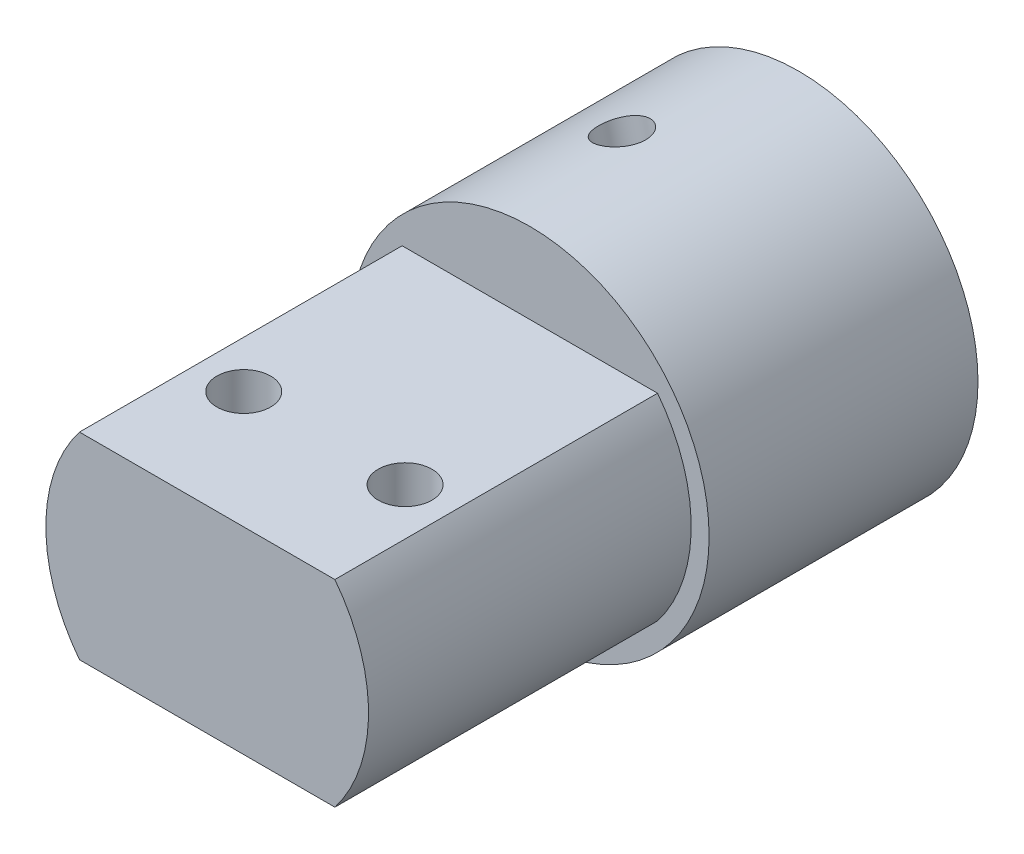
ISO-10303-21;
HEADER;
FILE_DESCRIPTION(('STEP AP214'),'2;1');
FILE_NAME('part.step','',(''),(''),'','','');
FILE_SCHEMA(('AUTOMOTIVE_DESIGN { 1 0 10303 214 1 1 1 1 }'));
ENDSEC;
DATA;
#1=APPLICATION_CONTEXT('core data for automotive mechanical design processes');
#2=APPLICATION_PROTOCOL_DEFINITION('international standard','automotive_design',2000,#1);
#3=PRODUCT_CONTEXT('',#1,'mechanical');
#4=PRODUCT('Part','Part','',(#3));
#5=PRODUCT_RELATED_PRODUCT_CATEGORY('part','',(#4));
#6=PRODUCT_DEFINITION_FORMATION('','',#4);
#7=PRODUCT_DEFINITION_CONTEXT('part definition',#1,'design');
#8=PRODUCT_DEFINITION('design','',#6,#7);
#9=PRODUCT_DEFINITION_SHAPE('','',#8);
#10=(LENGTH_UNIT() NAMED_UNIT(*) SI_UNIT(.MILLI.,.METRE.));
#11=(NAMED_UNIT(*) PLANE_ANGLE_UNIT() SI_UNIT($,.RADIAN.));
#12=(NAMED_UNIT(*) SI_UNIT($,.STERADIAN.) SOLID_ANGLE_UNIT());
#13=UNCERTAINTY_MEASURE_WITH_UNIT(LENGTH_MEASURE(1.E-05),#10,'distance_accuracy_value','');
#14=(GEOMETRIC_REPRESENTATION_CONTEXT(3) GLOBAL_UNCERTAINTY_ASSIGNED_CONTEXT((#13)) GLOBAL_UNIT_ASSIGNED_CONTEXT((#10,
#11,#12)) REPRESENTATION_CONTEXT('',''));
#15=CARTESIAN_POINT('',(0.,0.,0.));
#16=DIRECTION('',(0.,0.,1.));
#17=DIRECTION('',(1.,0.,0.));
#18=AXIS2_PLACEMENT_3D('',#15,#16,#17);
#19=CARTESIAN_POINT('',(0.,0.,15.));
#20=DIRECTION('',(0.,0.,1.));
#21=DIRECTION('',(1.,0.,0.));
#22=AXIS2_PLACEMENT_3D('',#19,#20,#21);
#23=PLANE('',#22);
#24=CARTESIAN_POINT('',(0.,0.,15.));
#25=DIRECTION('',(0.,0.,1.));
#26=DIRECTION('',(1.,0.,0.));
#27=AXIS2_PLACEMENT_3D('',#24,#25,#26);
#28=CIRCLE('',#27,9.);
#29=CARTESIAN_POINT('',(-7.1239034243875,5.5,15.));
#30=VERTEX_POINT('',#29);
#31=CARTESIAN_POINT('',(-7.1239034243875,-5.5,15.));
#32=VERTEX_POINT('',#31);
#33=EDGE_CURVE('E11',#30,#32,#28,.T.);
#34=ORIENTED_EDGE('',*,*,#33,.F.);
#35=DIRECTION('',(-1.,0.,0.));
#36=VECTOR('',#35,1.);
#37=CARTESIAN_POINT('',(-7.1239034243875,5.5,15.));
#38=LINE('',#37,#36);
#39=CARTESIAN_POINT('',(7.1239034243875,5.5,15.0000000000001));
#40=VERTEX_POINT('',#39);
#41=EDGE_CURVE('E133',#40,#30,#38,.T.);
#42=ORIENTED_EDGE('',*,*,#41,.F.);
#43=CARTESIAN_POINT('',(0.,0.,15.));
#44=DIRECTION('',(0.,0.,1.));
#45=DIRECTION('',(1.,0.,0.));
#46=AXIS2_PLACEMENT_3D('',#43,#44,#45);
#47=CIRCLE('',#46,9.);
#48=CARTESIAN_POINT('',(7.1239034243875,-5.5,15.));
#49=VERTEX_POINT('',#48);
#50=EDGE_CURVE('E141',#49,#40,#47,.T.);
#51=ORIENTED_EDGE('',*,*,#50,.F.);
#52=DIRECTION('',(1.,0.,0.));
#53=VECTOR('',#52,1.);
#54=CARTESIAN_POINT('',(-7.1239034243875,-5.5,15.));
#55=LINE('',#54,#53);
#56=EDGE_CURVE('E58',#32,#49,#55,.T.);
#57=ORIENTED_EDGE('',*,*,#56,.F.);
#58=EDGE_LOOP('',(#34,#42,#51,#57));
#59=FACE_BOUND('',#58,.T.);
#60=CARTESIAN_POINT('',(0.,0.,15.0000000000001));
#61=DIRECTION('',(0.,0.,-1.));
#62=DIRECTION('',(-1.,0.,0.));
#63=AXIS2_PLACEMENT_3D('',#60,#61,#62);
#64=CIRCLE('',#63,10.);
#65=CARTESIAN_POINT('',(-10.,0.,15.0000000000001));
#66=VERTEX_POINT('',#65);
#67=EDGE_CURVE('E112',#66,#66,#64,.T.);
#68=ORIENTED_EDGE('',*,*,#67,.F.);
#69=EDGE_LOOP('',(#68));
#70=FACE_BOUND('',#69,.T.);
#71=ADVANCED_FACE('F35',(#59,#70),#23,.T.);
#72=CARTESIAN_POINT('',(0.,0.,33.));
#73=DIRECTION('',(0.,0.,-1.));
#74=DIRECTION('',(-1.,0.,0.));
#75=AXIS2_PLACEMENT_3D('',#72,#73,#74);
#76=CYLINDRICAL_SURFACE('',#75,9.);
#77=DIRECTION('',(0.,0.,-1.));
#78=VECTOR('',#77,1.);
#79=CARTESIAN_POINT('',(-7.1239034243875,5.5,33.));
#80=LINE('',#79,#78);
#81=CARTESIAN_POINT('',(-7.1239034243875,5.5,33.));
#82=VERTEX_POINT('',#81);
#83=EDGE_CURVE('E138',#82,#30,#80,.T.);
#84=ORIENTED_EDGE('',*,*,#83,.T.);
#85=ORIENTED_EDGE('',*,*,#33,.T.);
#86=DIRECTION('',(0.,0.,-1.));
#87=VECTOR('',#86,1.);
#88=CARTESIAN_POINT('',(-7.1239034243875,-5.5,33.));
#89=LINE('',#88,#87);
#90=CARTESIAN_POINT('',(-7.1239034243875,-5.5,33.));
#91=VERTEX_POINT('',#90);
#92=EDGE_CURVE('E39',#91,#32,#89,.T.);
#93=ORIENTED_EDGE('',*,*,#92,.F.);
#94=CARTESIAN_POINT('',(0.,0.,33.));
#95=DIRECTION('',(0.,0.,1.));
#96=DIRECTION('',(1.,0.,0.));
#97=AXIS2_PLACEMENT_3D('',#94,#95,#96);
#98=CIRCLE('',#97,9.);
#99=EDGE_CURVE('E129',#82,#91,#98,.T.);
#100=ORIENTED_EDGE('',*,*,#99,.F.);
#101=EDGE_LOOP('',(#84,#85,#93,#100));
#102=FACE_BOUND('',#101,.T.);
#103=ADVANCED_FACE('F159',(#102),#76,.T.);
#104=CARTESIAN_POINT('',(-7.1239034243875,-5.5,33.));
#105=DIRECTION('',(0.,1.,0.));
#106=DIRECTION('',(-1.,0.,0.));
#107=AXIS2_PLACEMENT_3D('',#104,#105,#106);
#108=PLANE('',#107);
#109=CARTESIAN_POINT('',(-4.5,-5.5,26.46));
#110=DIRECTION('',(0.,1.,0.));
#111=DIRECTION('',(-1.,0.,0.));
#112=AXIS2_PLACEMENT_3D('',#109,#110,#111);
#113=CIRCLE('',#112,1.5);
#114=CARTESIAN_POINT('',(-6.,-5.5,26.46));
#115=VERTEX_POINT('',#114);
#116=EDGE_CURVE('E120',#115,#115,#113,.T.);
#117=ORIENTED_EDGE('',*,*,#116,.T.);
#118=EDGE_LOOP('',(#117));
#119=FACE_BOUND('',#118,.T.);
#120=CARTESIAN_POINT('',(4.5,-5.5,26.46));
#121=DIRECTION('',(0.,1.,0.));
#122=DIRECTION('',(-1.,0.,0.));
#123=AXIS2_PLACEMENT_3D('',#120,#121,#122);
#124=CIRCLE('',#123,1.5);
#125=CARTESIAN_POINT('',(3.,-5.5,26.46));
#126=VERTEX_POINT('',#125);
#127=EDGE_CURVE('E126',#126,#126,#124,.T.);
#128=ORIENTED_EDGE('',*,*,#127,.T.);
#129=EDGE_LOOP('',(#128));
#130=FACE_BOUND('',#129,.T.);
#131=ORIENTED_EDGE('',*,*,#56,.T.);
#132=DIRECTION('',(0.,0.,-1.));
#133=VECTOR('',#132,1.);
#134=CARTESIAN_POINT('',(7.1239034243875,-5.5,33.));
#135=LINE('',#134,#133);
#136=CARTESIAN_POINT('',(7.1239034243875,-5.5,33.));
#137=VERTEX_POINT('',#136);
#138=EDGE_CURVE('E148',#137,#49,#135,.T.);
#139=ORIENTED_EDGE('',*,*,#138,.F.);
#140=DIRECTION('',(1.,0.,0.));
#141=VECTOR('',#140,1.);
#142=CARTESIAN_POINT('',(-7.1239034243875,-5.5,33.));
#143=LINE('',#142,#141);
#144=EDGE_CURVE('E132',#91,#137,#143,.T.);
#145=ORIENTED_EDGE('',*,*,#144,.F.);
#146=ORIENTED_EDGE('',*,*,#92,.T.);
#147=EDGE_LOOP('',(#131,#139,#145,#146));
#148=FACE_BOUND('',#147,.T.);
#149=ADVANCED_FACE('F156',(#119,#130,#148),#108,.F.);
#150=CARTESIAN_POINT('',(0.,0.,33.));
#151=DIRECTION('',(0.,0.,-1.));
#152=DIRECTION('',(-1.,0.,0.));
#153=AXIS2_PLACEMENT_3D('',#150,#151,#152);
#154=CYLINDRICAL_SURFACE('',#153,9.);
#155=ORIENTED_EDGE('',*,*,#50,.T.);
#156=DIRECTION('',(0.,0.,-1.));
#157=VECTOR('',#156,1.);
#158=CARTESIAN_POINT('',(7.1239034243875,5.5,33.));
#159=LINE('',#158,#157);
#160=CARTESIAN_POINT('',(7.1239034243875,5.5,33.));
#161=VERTEX_POINT('',#160);
#162=EDGE_CURVE('E146',#161,#40,#159,.T.);
#163=ORIENTED_EDGE('',*,*,#162,.F.);
#164=CARTESIAN_POINT('',(0.,0.,33.));
#165=DIRECTION('',(0.,0.,1.));
#166=DIRECTION('',(1.,0.,0.));
#167=AXIS2_PLACEMENT_3D('',#164,#165,#166);
#168=CIRCLE('',#167,9.);
#169=EDGE_CURVE('E135',#137,#161,#168,.T.);
#170=ORIENTED_EDGE('',*,*,#169,.F.);
#171=ORIENTED_EDGE('',*,*,#138,.T.);
#172=EDGE_LOOP('',(#155,#163,#170,#171));
#173=FACE_BOUND('',#172,.T.);
#174=ADVANCED_FACE('F167',(#173),#154,.T.);
#175=CARTESIAN_POINT('',(-7.1239034243875,5.5,33.));
#176=DIRECTION('',(0.,-1.,0.));
#177=DIRECTION('',(0.,0.,-1.));
#178=AXIS2_PLACEMENT_3D('',#175,#176,#177);
#179=PLANE('',#178);
#180=CARTESIAN_POINT('',(-4.5,5.5,26.46));
#181=DIRECTION('',(0.,1.,0.));
#182=DIRECTION('',(0.,0.,-1.));
#183=AXIS2_PLACEMENT_3D('',#180,#181,#182);
#184=CIRCLE('',#183,1.5);
#185=CARTESIAN_POINT('',(-4.5,5.5,24.96));
#186=VERTEX_POINT('',#185);
#187=EDGE_CURVE('E115',#186,#186,#184,.T.);
#188=ORIENTED_EDGE('',*,*,#187,.F.);
#189=EDGE_LOOP('',(#188));
#190=FACE_BOUND('',#189,.T.);
#191=CARTESIAN_POINT('',(4.5,5.5,26.46));
#192=DIRECTION('',(0.,1.,0.));
#193=DIRECTION('',(0.,0.,1.));
#194=AXIS2_PLACEMENT_3D('',#191,#192,#193);
#195=CIRCLE('',#194,1.5);
#196=CARTESIAN_POINT('',(4.5,5.5,27.96));
#197=VERTEX_POINT('',#196);
#198=EDGE_CURVE('E123',#197,#197,#195,.T.);
#199=ORIENTED_EDGE('',*,*,#198,.F.);
#200=EDGE_LOOP('',(#199));
#201=FACE_BOUND('',#200,.T.);
#202=ORIENTED_EDGE('',*,*,#41,.T.);
#203=ORIENTED_EDGE('',*,*,#83,.F.);
#204=DIRECTION('',(-1.,0.,0.));
#205=VECTOR('',#204,1.);
#206=CARTESIAN_POINT('',(-7.1239034243875,5.5,33.));
#207=LINE('',#206,#205);
#208=EDGE_CURVE('E137',#161,#82,#207,.T.);
#209=ORIENTED_EDGE('',*,*,#208,.F.);
#210=ORIENTED_EDGE('',*,*,#162,.T.);
#211=EDGE_LOOP('',(#202,#203,#209,#210));
#212=FACE_BOUND('',#211,.T.);
#213=ADVANCED_FACE('F166',(#190,#201,#212),#179,.F.);
#214=CARTESIAN_POINT('',(0.,0.,33.));
#215=DIRECTION('',(0.,0.,1.));
#216=DIRECTION('',(1.,0.,0.));
#217=AXIS2_PLACEMENT_3D('',#214,#215,#216);
#218=PLANE('',#217);
#219=ORIENTED_EDGE('',*,*,#99,.T.);
#220=ORIENTED_EDGE('',*,*,#144,.T.);
#221=ORIENTED_EDGE('',*,*,#169,.T.);
#222=ORIENTED_EDGE('',*,*,#208,.T.);
#223=EDGE_LOOP('',(#219,#220,#221,#222));
#224=FACE_BOUND('',#223,.T.);
#225=ADVANCED_FACE('F169',(#224),#218,.T.);
#226=CARTESIAN_POINT('',(4.5,-8.,26.46));
#227=DIRECTION('',(0.,1.,0.));
#228=DIRECTION('',(0.,0.,1.));
#229=AXIS2_PLACEMENT_3D('',#226,#227,#228);
#230=CYLINDRICAL_SURFACE('',#229,1.5);
#231=ORIENTED_EDGE('',*,*,#198,.T.);
#232=EDGE_LOOP('',(#231));
#233=FACE_BOUND('',#232,.T.);
#234=ORIENTED_EDGE('',*,*,#127,.F.);
#235=EDGE_LOOP('',(#234));
#236=FACE_BOUND('',#235,.T.);
#237=ADVANCED_FACE('F171',(#233,#236),#230,.F.);
#238=CARTESIAN_POINT('',(-4.5,-8.,26.46));
#239=DIRECTION('',(0.,1.,0.));
#240=DIRECTION('',(0.,0.,1.));
#241=AXIS2_PLACEMENT_3D('',#238,#239,#240);
#242=CYLINDRICAL_SURFACE('',#241,1.5);
#243=ORIENTED_EDGE('',*,*,#187,.T.);
#244=EDGE_LOOP('',(#243));
#245=FACE_BOUND('',#244,.T.);
#246=ORIENTED_EDGE('',*,*,#116,.F.);
#247=EDGE_LOOP('',(#246));
#248=FACE_BOUND('',#247,.T.);
#249=ADVANCED_FACE('F177',(#245,#248),#242,.F.);
#250=CARTESIAN_POINT('',(0.,0.,15.0000000000001));
#251=DIRECTION('',(0.,0.,-1.));
#252=DIRECTION('',(-1.,0.,0.));
#253=AXIS2_PLACEMENT_3D('',#250,#251,#252);
#254=CYLINDRICAL_SURFACE('',#253,10.);
#255=CARTESIAN_POINT('',(-0.996082210921019,9.9502673446037,7.54425654717013));
#256=CARTESIAN_POINT('',(-0.996085569211242,9.95026773078794,7.46879808682767));
#257=CARTESIAN_POINT('',(-1.00245849987856,9.94963541669566,7.39329373290986));
#258=CARTESIAN_POINT('',(-1.02776168364104,9.94705290197722,7.24438999613723));
#259=CARTESIAN_POINT('',(-1.04670472786305,9.94510135888889,7.17099283697872));
#260=CARTESIAN_POINT('',(-1.09652640861288,9.93973105934153,7.02848072188487));
#261=CARTESIAN_POINT('',(-1.12739654404615,9.93631334771054,6.95936275655158));
#262=CARTESIAN_POINT('',(-1.20010141081621,9.9277938125132,6.82729079880411));
#263=CARTESIAN_POINT('',(-1.24193440647953,9.92269225550525,6.76433583281033));
#264=CARTESIAN_POINT('',(-1.33557504027768,9.91052344574325,6.64595558742679));
#265=CARTESIAN_POINT('',(-1.38743926674039,9.90344493490688,6.59057622222731));
#266=CARTESIAN_POINT('',(-1.49944240190236,9.88710620028703,6.48931629970337));
#267=CARTESIAN_POINT('',(-1.55958173800796,9.87784586379547,6.44343623332094));
#268=CARTESIAN_POINT('',(-1.68661785533062,9.85695051753294,6.36231063892214));
#269=CARTESIAN_POINT('',(-1.75353989295336,9.8453064543468,6.32710696383031));
#270=CARTESIAN_POINT('',(-1.89197410613285,9.8196427620677,6.2686017141424));
#271=CARTESIAN_POINT('',(-1.96348608397587,9.80562323525629,6.24529962726692));
#272=CARTESIAN_POINT('',(-2.10854893948712,9.77545260355273,6.21139702149996));
#273=CARTESIAN_POINT('',(-2.18208472623096,9.75931501715958,6.20071992135965));
#274=CARTESIAN_POINT('',(-2.32946971555062,9.72518847969694,6.19213286412167));
#275=CARTESIAN_POINT('',(-2.40331890371233,9.7071996129063,6.19422232608356));
#276=CARTESIAN_POINT('',(-2.54873456940718,9.67003359017981,6.21104806411272));
#277=CARTESIAN_POINT('',(-2.62031277262983,9.650864926972,6.22570196902097));
#278=CARTESIAN_POINT('',(-2.75970687150496,9.61193312080782,6.26711165736199));
#279=CARTESIAN_POINT('',(-2.8275226857262,9.59216996499882,6.29386770261271));
#280=CARTESIAN_POINT('',(-2.9577752904473,9.55281181623111,6.35880851777019));
#281=CARTESIAN_POINT('',(-3.02019469949489,9.53321753724787,6.39702856594685));
#282=CARTESIAN_POINT('',(-3.13778915705267,9.49516218424313,6.48378676396809));
#283=CARTESIAN_POINT('',(-3.19296381812309,9.47670117085531,6.53232546527765));
#284=CARTESIAN_POINT('',(-3.29506163001102,9.44169004163665,6.63880355847788));
#285=CARTESIAN_POINT('',(-3.34191551233879,9.42515632812846,6.69681478990305));
#286=CARTESIAN_POINT('',(-3.42561347833496,9.39506023186682,6.8203454659799));
#287=CARTESIAN_POINT('',(-3.46245752045142,9.38149786144777,6.88586494179752));
#288=CARTESIAN_POINT('',(-3.52518695914421,9.35810791437745,7.02261974131502));
#289=CARTESIAN_POINT('',(-3.55106635567842,9.34828238288871,7.0938581692286));
#290=CARTESIAN_POINT('',(-3.59113964875508,9.33296204569217,7.2399929637156));
#291=CARTESIAN_POINT('',(-3.60533420599422,9.32746699512643,7.31488912321594));
#292=CARTESIAN_POINT('',(-3.62158587556314,9.32116904399569,7.46558290900987));
#293=CARTESIAN_POINT('',(-3.62373752725546,9.3203295964364,7.54136881993138));
#294=CARTESIAN_POINT('',(-3.61609850095861,9.32329597095549,7.69224291430307));
#295=CARTESIAN_POINT('',(-3.60630812110902,9.32710167706499,7.76733111512482));
#296=CARTESIAN_POINT('',(-3.5751146654553,9.33910218964477,7.91437343721903));
#297=CARTESIAN_POINT('',(-3.55375795427668,9.34727947060941,7.98633884075092));
#298=CARTESIAN_POINT('',(-3.50002786425586,9.36753032359071,8.12544676004661));
#299=CARTESIAN_POINT('',(-3.46765403799845,9.37960405384475,8.19258907980639));
#300=CARTESIAN_POINT('',(-3.39249564040762,9.40704935691697,8.32059781086229));
#301=CARTESIAN_POINT('',(-3.34964839980042,9.42244071317889,8.38142317968879));
#302=CARTESIAN_POINT('',(-3.25474778393785,9.45564052012152,8.49465144349365));
#303=CARTESIAN_POINT('',(-3.20269398955868,9.47344908083567,8.5470539548182));
#304=CARTESIAN_POINT('',(-3.09033764471545,9.51069569619044,8.64230484841067));
#305=CARTESIAN_POINT('',(-3.0299822685472,9.53014384980765,8.68508700726009));
#306=CARTESIAN_POINT('',(-2.90288429316271,9.56962301691317,8.75942335333693));
#307=CARTESIAN_POINT('',(-2.83614184070936,9.58965401700141,8.79097779847736));
#308=CARTESIAN_POINT('',(-2.698293675771,9.62934761133667,8.84185498067603));
#309=CARTESIAN_POINT('',(-2.62720207992797,9.64901115254119,8.86121520462622));
#310=CARTESIAN_POINT('',(-2.48245578390818,9.68726037314897,8.88727610652297));
#311=CARTESIAN_POINT('',(-2.40880121976691,9.70584610961999,8.89397745532799));
#312=CARTESIAN_POINT('',(-2.26162894257498,9.74118663186999,8.89451639182475));
#313=CARTESIAN_POINT('',(-2.18811479400818,9.7579547950289,8.88845578953387));
#314=CARTESIAN_POINT('',(-2.04275018524541,9.78941795753199,8.86385947423466));
#315=CARTESIAN_POINT('',(-1.97089972246056,9.80411296010242,8.84532378064037));
#316=CARTESIAN_POINT('',(-1.83096815669178,9.83120727223162,8.79633702560981));
#317=CARTESIAN_POINT('',(-1.76288526486947,9.8436076779327,8.7658916752442));
#318=CARTESIAN_POINT('',(-1.63240809078384,9.86608493843242,8.69396045261476));
#319=CARTESIAN_POINT('',(-1.57001392127936,9.87616174718001,8.65247436157105));
#320=CARTESIAN_POINT('',(-1.45226201077925,9.8941657282521,8.55926569367407));
#321=CARTESIAN_POINT('',(-1.39696149259925,9.90207594033265,8.50746754488701));
#322=CARTESIAN_POINT('',(-1.29558065539634,9.91585071169199,8.39526335201504));
#323=CARTESIAN_POINT('',(-1.24950251400565,9.92171478806972,8.33485528066515));
#324=CARTESIAN_POINT('',(-1.1677913564916,9.93166503570519,8.2068300228588));
#325=CARTESIAN_POINT('',(-1.13220636074607,9.9357430734432,8.13918156695415));
#326=CARTESIAN_POINT('',(-1.07291292362519,9.94232144429035,7.99885068338833));
#327=CARTESIAN_POINT('',(-1.04919178831171,9.94482346443333,7.92617373127473));
#328=CARTESIAN_POINT('',(-1.01993123878521,9.9478578038677,7.80165831374297));
#329=CARTESIAN_POINT('',(-1.01100203976609,9.94876430388292,7.75059947139429));
#330=CARTESIAN_POINT('',(-0.999076401719257,9.94996893888668,7.64778646628034));
#331=CARTESIAN_POINT('',(-0.996079906632836,9.95026707962369,7.5960323100898));
#332=CARTESIAN_POINT('',(-0.996082210921019,9.9502673446037,7.54425654717013));
#333=B_SPLINE_CURVE_WITH_KNOTS('',3,(#255,#256,#257,#258,#259,#260,#261,#262,#263,#264,#265,
#266,#267,#268,#269,#270,#271,#272,#273,#274,#275,#276,#277,#278,#279,#280,#281,#282,#283,#284,
#285,#286,#287,#288,#289,#290,#291,#292,#293,#294,#295,#296,#297,#298,#299,#300,#301,#302,#303,
#304,#305,#306,#307,#308,#309,#310,#311,#312,#313,#314,#315,#316,#317,#318,#319,#320,#321,#322,
#323,#324,#325,#326,#327,#328,#329,#330,#331,#332),.UNSPECIFIED.,.T.,.F.,(4,2,2,2,2,2,2,2,2,2,2,
2,2,2,2,2,2,2,2,2,2,2,2,2,2,2,2,2,2,2,2,2,2,2,2,2,2,2,4),(0.,0.226186199011538,
0.452602914805032,0.67885854776645,0.905078380864557,1.13261369021356,1.36016075609156,
1.58858863865224,1.81700668817553,2.0440319623552,2.27104690586187,2.49658484458527,
2.72212766283419,2.94837179354983,3.17462801858569,3.40268748613209,3.63074790036342,
3.85893295248074,4.08710510142812,4.31348351125702,4.53985626953658,4.76532823827695,
4.99080936473528,5.21767421975933,5.44454940535291,5.6729415223162,5.90132839252127,
6.12900969531528,6.35667893177535,6.58253879282745,6.80839830239165,7.03414963742795,
7.25990544621565,7.48738101540436,7.71491023402139,7.94346509884248,8.17177489153609,
8.32697383970201,8.48217132137041),.UNSPECIFIED.);
#334=CARTESIAN_POINT('',(-0.996082210921019,9.9502673446037,7.54425654717013));
#335=VERTEX_POINT('',#334);
#336=EDGE_CURVE('E108',#335,#335,#333,.T.);
#337=ORIENTED_EDGE('',*,*,#336,.F.);
#338=EDGE_LOOP('',(#337));
#339=FACE_BOUND('',#338,.T.);
#340=ORIENTED_EDGE('',*,*,#67,.T.);
#341=EDGE_LOOP('',(#340));
#342=FACE_BOUND('',#341,.T.);
#343=CARTESIAN_POINT('',(0.,0.,0.));
#344=DIRECTION('',(0.,0.,-1.));
#345=DIRECTION('',(-1.,0.,0.));
#346=AXIS2_PLACEMENT_3D('',#343,#344,#345);
#347=CIRCLE('',#346,10.);
#348=CARTESIAN_POINT('',(-10.,0.,0.));
#349=VERTEX_POINT('',#348);
#350=EDGE_CURVE('E110',#349,#349,#347,.T.);
#351=ORIENTED_EDGE('',*,*,#350,.F.);
#352=EDGE_LOOP('',(#351));
#353=FACE_BOUND('',#352,.T.);
#354=ADVANCED_FACE('F214',(#339,#342,#353),#254,.T.);
#355=CARTESIAN_POINT('',(0.,0.,0.));
#356=DIRECTION('',(0.,0.,1.));
#357=DIRECTION('',(1.,0.,0.));
#358=AXIS2_PLACEMENT_3D('',#355,#356,#357);
#359=PLANE('',#358);
#360=ORIENTED_EDGE('',*,*,#350,.T.);
#361=EDGE_LOOP('',(#360));
#362=FACE_BOUND('',#361,.T.);
#363=CARTESIAN_POINT('',(0.,0.,0.));
#364=DIRECTION('',(0.,0.,-1.));
#365=DIRECTION('',(-1.,0.,0.));
#366=AXIS2_PLACEMENT_3D('',#363,#364,#365);
#367=CIRCLE('',#366,5.);
#368=CARTESIAN_POINT('',(1.98531234467396,4.58895793117405,0.));
#369=VERTEX_POINT('',#368);
#370=CARTESIAN_POINT('',(-3.84951215741354,3.19080807162157,0.));
#371=VERTEX_POINT('',#370);
#372=EDGE_CURVE('E97',#369,#371,#367,.T.);
#373=ORIENTED_EDGE('',*,*,#372,.F.);
#374=DIRECTION('',(0.972470750348899,0.233024976592315,0.));
#375=VECTOR('',#374,1.);
#376=CARTESIAN_POINT('',(1.98531234467396,4.58895793117405,0.));
#377=LINE('',#376,#375);
#378=EDGE_CURVE('E91',#371,#369,#377,.T.);
#379=ORIENTED_EDGE('',*,*,#378,.F.);
#380=EDGE_LOOP('',(#373,#379));
#381=FACE_BOUND('',#380,.T.);
#382=ADVANCED_FACE('F37',(#362,#381),#359,.F.);
#383=CARTESIAN_POINT('',(0.,0.,15.0000000000001));
#384=DIRECTION('',(0.,0.,-1.));
#385=DIRECTION('',(-1.,0.,0.));
#386=AXIS2_PLACEMENT_3D('',#383,#384,#385);
#387=CYLINDRICAL_SURFACE('',#386,5.);
#388=ORIENTED_EDGE('',*,*,#372,.T.);
#389=DIRECTION('',(0.,0.,-1.));
#390=VECTOR('',#389,1.);
#391=CARTESIAN_POINT('',(-3.84951215741354,3.19080807162157,15.0000000000001));
#392=LINE('',#391,#390);
#393=CARTESIAN_POINT('',(-3.84951215741354,3.19080807162157,15.0000000000001));
#394=VERTEX_POINT('',#393);
#395=EDGE_CURVE('E94',#394,#371,#392,.T.);
#396=ORIENTED_EDGE('',*,*,#395,.F.);
#397=CARTESIAN_POINT('',(0.,0.,15.0000000000001));
#398=DIRECTION('',(0.,0.,-1.));
#399=DIRECTION('',(-1.,0.,0.));
#400=AXIS2_PLACEMENT_3D('',#397,#398,#399);
#401=CIRCLE('',#400,5.);
#402=CARTESIAN_POINT('',(1.98531234467396,4.58895793117405,15.));
#403=VERTEX_POINT('',#402);
#404=EDGE_CURVE('E86',#403,#394,#401,.T.);
#405=ORIENTED_EDGE('',*,*,#404,.F.);
#406=DIRECTION('',(0.,0.,-1.));
#407=VECTOR('',#406,1.);
#408=CARTESIAN_POINT('',(1.98531234467396,4.58895793117405,15.0000000000001));
#409=LINE('',#408,#407);
#410=EDGE_CURVE('E101',#403,#369,#409,.T.);
#411=ORIENTED_EDGE('',*,*,#410,.T.);
#412=EDGE_LOOP('',(#388,#396,#405,#411));
#413=FACE_BOUND('',#412,.T.);
#414=ADVANCED_FACE('F95',(#413),#387,.F.);
#415=CARTESIAN_POINT('',(1.98531234467396,4.58895793117405,15.0000000000001));
#416=DIRECTION('',(-0.233024976592315,0.972470750348899,0.));
#417=DIRECTION('',(-0.972470750348899,-0.233024976592315,0.));
#418=AXIS2_PLACEMENT_3D('',#415,#416,#417);
#419=PLANE('',#418);
#420=CARTESIAN_POINT('',(-0.932099906369791,3.88988300139781,7.54425654717013));
#421=DIRECTION('',(0.233024976592315,-0.972470750348899,0.));
#422=DIRECTION('',(0.972470750348899,0.233024976592315,0.));
#423=AXIS2_PLACEMENT_3D('',#420,#421,#422);
#424=CIRCLE('',#423,1.35);
#425=CARTESIAN_POINT('',(0.380735606601223,4.20446671979744,7.54425654717013));
#426=VERTEX_POINT('',#425);
#427=EDGE_CURVE('E223',#426,#426,#424,.T.);
#428=ORIENTED_EDGE('',*,*,#427,.F.);
#429=EDGE_LOOP('',(#428));
#430=FACE_BOUND('',#429,.T.);
#431=ORIENTED_EDGE('',*,*,#378,.T.);
#432=ORIENTED_EDGE('',*,*,#410,.F.);
#433=DIRECTION('',(0.972470750348899,0.233024976592315,0.));
#434=VECTOR('',#433,1.);
#435=CARTESIAN_POINT('',(1.98531234467396,4.58895793117405,15.0000000000001));
#436=LINE('',#435,#434);
#437=EDGE_CURVE('E50',#394,#403,#436,.T.);
#438=ORIENTED_EDGE('',*,*,#437,.F.);
#439=ORIENTED_EDGE('',*,*,#395,.T.);
#440=EDGE_LOOP('',(#431,#432,#438,#439));
#441=FACE_BOUND('',#440,.T.);
#442=ADVANCED_FACE('F103',(#430,#441),#419,.F.);
#443=CARTESIAN_POINT('',(0.,0.,15.));
#444=DIRECTION('',(0.,0.,1.));
#445=DIRECTION('',(1.,0.,0.));
#446=AXIS2_PLACEMENT_3D('',#443,#444,#445);
#447=PLANE('',#446);
#448=ORIENTED_EDGE('',*,*,#404,.T.);
#449=ORIENTED_EDGE('',*,*,#437,.T.);
#450=EDGE_LOOP('',(#448,#449));
#451=FACE_BOUND('',#450,.T.);
#452=ADVANCED_FACE('F88',(#451),#447,.F.);
#453=CARTESIAN_POINT('',(-4.42747455525454,18.4769442566314,7.54425654717013));
#454=DIRECTION('',(0.233024976592315,-0.972470750348899,0.));
#455=DIRECTION('',(0.972470750348899,0.233024976592315,0.));
#456=AXIS2_PLACEMENT_3D('',#453,#454,#455);
#457=CYLINDRICAL_SURFACE('',#456,1.35);
#458=ORIENTED_EDGE('',*,*,#336,.T.);
#459=EDGE_LOOP('',(#458));
#460=FACE_BOUND('',#459,.T.);
#461=ORIENTED_EDGE('',*,*,#427,.T.);
#462=EDGE_LOOP('',(#461));
#463=FACE_BOUND('',#462,.T.);
#464=ADVANCED_FACE('F197',(#460,#463),#457,.F.);
#465=CLOSED_SHELL('',(#71,#103,#149,#174,#213,#225,#237,#249,#354,#382,#414,#442,#452,#464));
#466=MANIFOLD_SOLID_BREP('B2',#465);
#467=ADVANCED_BREP_SHAPE_REPRESENTATION('',(#18,#466),#14);
#468=SHAPE_DEFINITION_REPRESENTATION(#9,#467);
ENDSEC;
END-ISO-10303-21;
